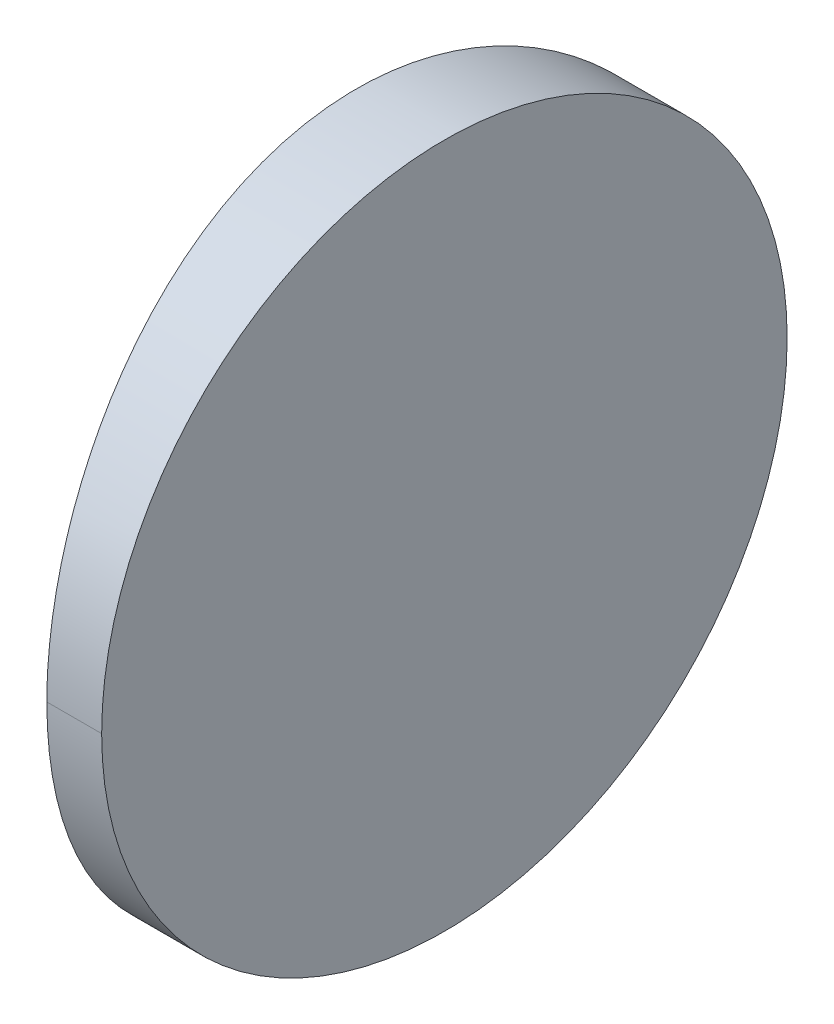
ISO-10303-21;
HEADER;
FILE_DESCRIPTION(('STEP AP214'),'2;1');
FILE_NAME('part.step','',(''),(''),'','','');
FILE_SCHEMA(('AUTOMOTIVE_DESIGN { 1 0 10303 214 1 1 1 1 }'));
ENDSEC;
DATA;
#1=APPLICATION_CONTEXT('core data for automotive mechanical design processes');
#2=APPLICATION_PROTOCOL_DEFINITION('international standard','automotive_design',2000,#1);
#3=PRODUCT_CONTEXT('',#1,'mechanical');
#4=PRODUCT('Part','Part','',(#3));
#5=PRODUCT_RELATED_PRODUCT_CATEGORY('part','',(#4));
#6=PRODUCT_DEFINITION_FORMATION('','',#4);
#7=PRODUCT_DEFINITION_CONTEXT('part definition',#1,'design');
#8=PRODUCT_DEFINITION('design','',#6,#7);
#9=PRODUCT_DEFINITION_SHAPE('','',#8);
#10=(LENGTH_UNIT() NAMED_UNIT(*) SI_UNIT(.MILLI.,.METRE.));
#11=(NAMED_UNIT(*) PLANE_ANGLE_UNIT() SI_UNIT($,.RADIAN.));
#12=(NAMED_UNIT(*) SI_UNIT($,.STERADIAN.) SOLID_ANGLE_UNIT());
#13=UNCERTAINTY_MEASURE_WITH_UNIT(LENGTH_MEASURE(1.E-05),#10,'distance_accuracy_value','');
#14=(GEOMETRIC_REPRESENTATION_CONTEXT(3) GLOBAL_UNCERTAINTY_ASSIGNED_CONTEXT((#13)) GLOBAL_UNIT_ASSIGNED_CONTEXT((#10,
#11,#12)) REPRESENTATION_CONTEXT('',''));
#15=CARTESIAN_POINT('',(0.,0.,0.));
#16=DIRECTION('',(0.,0.,1.));
#17=DIRECTION('',(1.,0.,0.));
#18=AXIS2_PLACEMENT_3D('',#15,#16,#17);
#19=CARTESIAN_POINT('',(-69.7247956651487,12.5,0.));
#20=DIRECTION('',(1.,0.,0.));
#21=DIRECTION('',(0.,0.,-1.));
#22=AXIS2_PLACEMENT_3D('',#19,#20,#21);
#23=CYLINDRICAL_SURFACE('',#22,12.5);
#24=DIRECTION('',(1.,0.,0.));
#25=VECTOR('',#24,1.);
#26=CARTESIAN_POINT('',(-69.7247956651487,12.5,12.5));
#27=LINE('',#26,#25);
#28=CARTESIAN_POINT('',(-59.0238931658232,12.5,12.5));
#29=VERTEX_POINT('',#28);
#30=CARTESIAN_POINT('',(-57.0247956651487,12.5,12.5));
#31=VERTEX_POINT('',#30);
#32=EDGE_CURVE('E60',#29,#31,#27,.T.);
#33=ORIENTED_EDGE('',*,*,#32,.F.);
#34=CARTESIAN_POINT('',(-59.0238931658232,12.5,12.5));
#35=CARTESIAN_POINT('',(-59.0238934111165,12.2973949439866,12.5000048487893));
#36=CARTESIAN_POINT('',(-59.0248782924547,12.0947905182912,12.4950743511268));
#37=CARTESIAN_POINT('',(-59.0287915261321,11.6886838905723,12.47530944615));
#38=CARTESIAN_POINT('',(-59.0317332263051,11.485185124926,12.4604070142007));
#39=CARTESIAN_POINT('',(-59.0395603444199,11.0777895177739,12.4205276454164));
#40=CARTESIAN_POINT('',(-59.0444591006648,10.8738997028536,12.3954815580978));
#41=CARTESIAN_POINT('',(-59.0561984617056,10.4662368020218,12.3351755541053));
#42=CARTESIAN_POINT('',(-59.0630523724705,10.2624744495084,12.2998456149912));
#43=CARTESIAN_POINT('',(-59.0783295032355,9.86547745771631,12.2208236543586));
#44=CARTESIAN_POINT('',(-59.0866753880738,9.672158062974,12.1775416438496));
#45=CARTESIAN_POINT('',(-59.1052113046292,9.28328809657888,12.0807227425628));
#46=CARTESIAN_POINT('',(-59.1154405243487,9.08779404606097,12.0269661621223));
#47=CARTESIAN_POINT('',(-59.1377444754954,8.69520669811822,11.9086755495263));
#48=CARTESIAN_POINT('',(-59.1498566932323,8.49818248545563,11.8439193495794));
#49=CARTESIAN_POINT('',(-59.1759227856845,8.10322170817393,11.703131650437));
#50=CARTESIAN_POINT('',(-59.1899124267658,7.90536722090443,11.6268762660254));
#51=CARTESIAN_POINT('',(-59.2177827510402,7.5357126946986,11.4735047580379));
#52=CARTESIAN_POINT('',(-59.2315018120931,7.3634664507522,11.3974317322579));
#53=CARTESIAN_POINT('',(-59.2607658139538,7.0133058751308,11.2332363969494));
#54=CARTESIAN_POINT('',(-59.2763696279973,6.83559876632946,11.1446820766058));
#55=CARTESIAN_POINT('',(-59.3094138727951,6.47554628750818,10.9544305060887));
#56=CARTESIAN_POINT('',(-59.3269076191299,6.29344052190166,10.8522891966566));
#57=CARTESIAN_POINT('',(-59.3636980281173,5.92575435694138,10.6337789938174));
#58=CARTESIAN_POINT('',(-59.3830410689332,5.74044773231712,10.5169562300519));
#59=CARTESIAN_POINT('',(-59.4166325799122,5.43250573682875,10.3113260100417));
#60=CARTESIAN_POINT('',(-59.4306112820348,5.30817627826116,10.2249974818105));
#61=CARTESIAN_POINT('',(-59.4621916722735,5.03400217167407,10.0271511242854));
#62=CARTESIAN_POINT('',(-59.479874883603,4.88500412630378,9.91447037014707));
#63=CARTESIAN_POINT('',(-59.5188726532772,4.56442798897067,9.66054156832797));
#64=CARTESIAN_POINT('',(-59.5402394172289,4.39393175259182,9.5179306797465));
#65=CARTESIAN_POINT('',(-59.5737385653417,4.13413245224687,9.28858103553876));
#66=CARTESIAN_POINT('',(-59.5857963020602,4.04212087523037,9.2048765159832));
#67=CARTESIAN_POINT('',(-59.610846306173,3.85417370185836,9.02870072537075));
#68=CARTESIAN_POINT('',(-59.6238439507349,3.75842557814165,8.93602973952716));
#69=CARTESIAN_POINT('',(-59.649499295712,3.57237392203008,8.75010509869603));
#70=CARTESIAN_POINT('',(-59.6621571104779,3.48199364619068,8.65692823434419));
#71=CARTESIAN_POINT('',(-59.6866035930923,3.30966309908345,8.47363800993337));
#72=CARTESIAN_POINT('',(-59.698397687726,3.22753681411497,8.38369049997133));
#73=CARTESIAN_POINT('',(-59.7313443970929,3.00109198214809,8.12827995684195));
#74=CARTESIAN_POINT('',(-59.7524116670259,2.85975461505502,7.96014309730327));
#75=CARTESIAN_POINT('',(-59.7911112899006,2.60608967186918,7.64170888810293));
#76=CARTESIAN_POINT('',(-59.8087962335007,2.4925386794846,7.49238910309623));
#77=CARTESIAN_POINT('',(-59.8406874128334,2.29107093903635,7.21470395692166));
#78=CARTESIAN_POINT('',(-59.8549716685329,2.20208960897634,7.08711829251616));
#79=CARTESIAN_POINT('',(-59.8887334359053,1.99362840484857,6.77599335657102));
#80=CARTESIAN_POINT('',(-59.9079547421535,1.87649932522733,6.5908428677263));
#81=CARTESIAN_POINT('',(-59.944521358798,1.657160100832,6.22306830279903));
#82=CARTESIAN_POINT('',(-59.9619121867267,1.55451515544169,6.04070753043465));
#83=CARTESIAN_POINT('',(-59.9947775949263,1.36309985442087,5.67971785469299));
#84=CARTESIAN_POINT('',(-60.0103038936127,1.27390305776435,5.50131984263335));
#85=CARTESIAN_POINT('',(-60.0394389300154,1.10832183152403,5.14933020635574));
#86=CARTESIAN_POINT('',(-60.0531045709718,1.03152145827128,4.9759387112348));
#87=CARTESIAN_POINT('',(-60.0807045317124,0.877519681840199,4.60571506184639));
#88=CARTESIAN_POINT('',(-60.0944905875027,0.801278438313892,4.40847140619934));
#89=CARTESIAN_POINT('',(-60.120186381391,0.660383119625356,4.01451164396618));
#90=CARTESIAN_POINT('',(-60.1321297676538,0.595517233957023,3.81787340502622));
#91=CARTESIAN_POINT('',(-60.1541335048892,0.476907113149795,3.42582340846234));
#92=CARTESIAN_POINT('',(-60.164229030936,0.422952464940169,3.23047729560302));
#93=CARTESIAN_POINT('',(-60.1825353871569,0.325672560345824,2.84165838920926));
#94=CARTESIAN_POINT('',(-60.1907828940336,0.282139000408903,2.64823939623316));
#95=CARTESIAN_POINT('',(-60.2059170931917,0.20244768597724,2.2501888937517));
#96=CARTESIAN_POINT('',(-60.2127198627724,0.166742131456625,2.04546346421591));
#97=CARTESIAN_POINT('',(-60.2243726206814,0.105775976861482,1.63579191468708));
#98=CARTESIAN_POINT('',(-60.2292352047992,0.0804479752817121,1.43085617499422));
#99=CARTESIAN_POINT('',(-60.2370059031225,0.0401033624794922,1.02129310712265));
#100=CARTESIAN_POINT('',(-60.2399266300464,0.0250201950583852,0.81667257570597));
#101=CARTESIAN_POINT('',(-60.2438140934801,0.00500669497695635,0.408253819180883));
#102=CARTESIAN_POINT('',(-60.2447934378603,1.08485243830229E-05,0.204458923445379));
#103=CARTESIAN_POINT('',(-60.2447978740114,-1.07567542771398E-05,-0.202067844350763));
#104=CARTESIAN_POINT('',(-60.2438331344716,0.00491160640269099,-0.404799715497574));
#105=CARTESIAN_POINT('',(-60.2399946201356,0.0246734743669953,-0.811087000469519));
#106=CARTESIAN_POINT('',(-60.2371084377355,0.0395774385472782,-1.01463916394297));
#107=CARTESIAN_POINT('',(-60.2294265815683,0.0794567317074173,-1.42206787178189));
#108=CARTESIAN_POINT('',(-60.224618495236,0.104497542897704,-1.6259377713288));
#109=CARTESIAN_POINT('',(-60.2130946585849,0.164780613090618,-2.03348826320776));
#110=CARTESIAN_POINT('',(-60.2063665132944,0.200089184892833,-2.2371587039275));
#111=CARTESIAN_POINT('',(-60.1913482363497,0.27915388993501,-2.63444738439542));
#112=CARTESIAN_POINT('',(-60.1831300588858,0.322522552495164,-2.82814560434876));
#113=CARTESIAN_POINT('',(-60.1648772446016,0.419491917976083,-3.21752706113229));
#114=CARTESIAN_POINT('',(-60.1548058509666,0.473301155055215,-3.41315668249607));
#115=CARTESIAN_POINT('',(-60.1328454481412,0.591640444610163,-3.80577672272048));
#116=CARTESIAN_POINT('',(-60.1209211881419,0.656381149021078,-4.0027016652233));
#117=CARTESIAN_POINT('',(-60.0952586411178,0.797046757205778,-4.39723659020499));
#118=CARTESIAN_POINT('',(-60.08148662873,0.873183717283128,-4.59476885355065));
#119=CARTESIAN_POINT('',(-60.053956617042,1.0267407417369,-4.9648865957859));
#120=CARTESIAN_POINT('',(-60.0403519961969,1.10316859352795,-5.13789625311636));
#121=CARTESIAN_POINT('',(-60.0113511044938,1.26791249048456,-5.48905646137268));
#122=CARTESIAN_POINT('',(-59.9958985599109,1.35663896599683,-5.66701005984294));
#123=CARTESIAN_POINT('',(-59.9631928593356,1.54700700771221,-6.02705829441964));
#124=CARTESIAN_POINT('',(-59.9458885159019,1.64906925750177,-6.20892579298482));
#125=CARTESIAN_POINT('',(-59.9095070861721,1.86712211151395,-6.57567673221329));
#126=CARTESIAN_POINT('',(-59.8903849174355,1.98354156366039,-6.7603012433079));
#127=CARTESIAN_POINT('',(-59.8566496017715,2.19162906383489,-7.07191712362963));
#128=CARTESIAN_POINT('',(-59.8422867858668,2.28101102050511,-7.20047003907686));
#129=CARTESIAN_POINT('',(-59.8102385491528,2.48328099934842,-7.48003218376792));
#130=CARTESIAN_POINT('',(-59.7924741248237,2.59723899435782,-7.63025982608186));
#131=CARTESIAN_POINT('',(-59.7536155955863,2.85173173895894,-7.9504422113));
#132=CARTESIAN_POINT('',(-59.7324680769503,2.99349456000898,-8.1194177767963));
#133=CARTESIAN_POINT('',(-59.6993987532632,3.22061539132784,-8.37603534242138));
#134=CARTESIAN_POINT('',(-59.6875643793713,3.30296361981507,-8.46637242434928));
#135=CARTESIAN_POINT('',(-59.6630371371057,3.47574501882702,-8.65042064089451));
#136=CARTESIAN_POINT('',(-59.6503387642659,3.56635463616604,-8.74396576395325));
#137=CARTESIAN_POINT('',(-59.6246783072099,3.75232421022672,-8.93005158546302));
#138=CARTESIAN_POINT('',(-59.6117161106175,3.84774329380468,-9.02253319092564));
#139=CARTESIAN_POINT('',(-59.5867379033952,4.03500473326411,-9.19832747909939));
#140=CARTESIAN_POINT('',(-59.5747165910804,4.12665949532594,-9.28183971448949));
#141=CARTESIAN_POINT('',(-59.5413320438138,4.38532663699196,-9.51057522387746));
#142=CARTESIAN_POINT('',(-59.5200415134037,4.5550271542648,-9.65279185551949));
#143=CARTESIAN_POINT('',(-59.4811995246292,4.87390834399103,-9.90592004935866));
#144=CARTESIAN_POINT('',(-59.4635967004774,5.02200756881771,-10.0181911209653));
#145=CARTESIAN_POINT('',(-59.4321801263303,5.2942865804486,-10.215198247502));
#146=CARTESIAN_POINT('',(-59.4182858315008,5.41762105582,-10.3010924983991));
#147=CARTESIAN_POINT('',(-59.3846710683119,5.72507765481962,-10.5070794819256));
#148=CARTESIAN_POINT('',(-59.3652263458907,5.9109451370394,-10.6246268079066));
#149=CARTESIAN_POINT('',(-59.3282464030829,6.27972006060333,-10.8444451359443));
#150=CARTESIAN_POINT('',(-59.3106643547472,6.46234903188176,-10.9471764656644));
#151=CARTESIAN_POINT('',(-59.2774576726362,6.82339707526118,-11.1384832492065));
#152=CARTESIAN_POINT('',(-59.261779158766,7.00157253121048,-11.2275089837338));
#153=CARTESIAN_POINT('',(-59.2323800118476,7.35260378264038,-11.3925384661496));
#154=CARTESIAN_POINT('',(-59.2185998323817,7.52524897824578,-11.4689801568464));
#155=CARTESIAN_POINT('',(-59.1906593651612,7.89505582702475,-11.6227924749215));
#156=CARTESIAN_POINT('',(-59.1766556862318,8.09265132083762,-11.6991512886893));
#157=CARTESIAN_POINT('',(-59.150556768491,8.48709613465402,-11.8401641096268));
#158=CARTESIAN_POINT('',(-59.1384258378319,8.68386321768595,-11.9050417919945));
#159=CARTESIAN_POINT('',(-59.1160797981408,9.07593941554491,-12.0235930314992));
#160=CARTESIAN_POINT('',(-59.1058272754873,9.27117926918379,-12.0774885528716));
#161=CARTESIAN_POINT('',(-59.0872399120019,9.65954483685961,-12.1746023324143));
#162=CARTESIAN_POINT('',(-59.0788659599775,9.85261383987354,-12.2180400842456));
#163=CARTESIAN_POINT('',(-59.0634745148696,10.2504399563658,-12.2976695113297));
#164=CARTESIAN_POINT('',(-59.0565466117767,10.4552958894061,-12.3333858922751));
#165=CARTESIAN_POINT('',(-59.0446807261429,10.8651521515466,-12.3943495365733));
#166=CARTESIAN_POINT('',(-59.0397291850555,11.0701414818917,-12.4196681681201));
#167=CARTESIAN_POINT('',(-59.0318177900048,11.4797336564933,-12.459979947368));
#168=CARTESIAN_POINT('',(-59.0288443446259,11.6843293002299,-12.4750435738634));
#169=CARTESIAN_POINT('',(-59.0248889531182,12.0926187653779,-12.4950214140943));
#170=CARTESIAN_POINT('',(-59.0238934044035,12.2963090657991,-12.500004955905));
#171=CARTESIAN_POINT('',(-59.0238931658232,12.5000000000001,-12.5));
#172=B_SPLINE_CURVE_WITH_KNOTS('',3,(#34,#35,#36,#37,#38,#39,#40,#41,#42,#43,#44,#45,#46,#47,
#48,#49,#50,#51,#52,#53,#54,#55,#56,#57,#58,#59,#60,#61,#62,#63,#64,#65,#66,#67,#68,#69,#70,#71,
#72,#73,#74,#75,#76,#77,#78,#79,#80,#81,#82,#83,#84,#85,#86,#87,#88,#89,#90,#91,#92,#93,#94,#95,
#96,#97,#98,#99,#100,#101,#102,#103,#104,#105,#106,#107,#108,#109,#110,#111,#112,#113,#114,#115,
#116,#117,#118,#119,#120,#121,#122,#123,#124,#125,#126,#127,#128,#129,#130,#131,#132,#133,#134,
#135,#136,#137,#138,#139,#140,#141,#142,#143,#144,#145,#146,#147,#148,#149,#150,#151,#152,#153,
#154,#155,#156,#157,#158,#159,#160,#161,#162,#163,#164,#165,#166,#167,#168,#169,#170,#171),
.UNSPECIFIED.,.F.,.F.,(4,2,2,2,2,2,2,2,2,2,2,2,2,2,2,2,2,2,2,2,2,2,2,2,2,2,2,2,2,2,2,2,2,2,2,2,
2,2,2,2,2,2,2,2,2,2,2,2,2,2,2,2,2,2,2,2,2,2,2,2,2,2,2,2,2,2,2,2,4),(0.,0.607752157813164,
1.21969301064746,1.83587770512788,2.45636025589361,3.05097541710052,3.65975259130253,
4.28273172369931,4.91995007201459,5.48615070409916,6.08340362164191,6.71172550822567,
7.37113051738123,7.82705873396953,8.3898048142942,9.05936071145659,9.43423023083276,
9.83580742831936,10.2270185263446,10.594084747146,11.2557249284191,11.8208052869677,
12.2893199267801,12.9487882288098,13.5784844265259,14.1784232674411,14.7486219829741,
15.3840820858889,16.00603783445,16.6145257393094,17.2095848053072,17.8330964235955,
18.452491606132,19.0678233431868,19.679145682106,20.2872787497822,20.8993773919695,
21.515494836714,22.1356832769347,22.7314459497587,23.3406326138324,23.9632825138026,
24.599432388453,25.168123778604,25.7662299309603,26.3937680498447,27.0507528809537,
27.5223420418294,28.0903365446505,28.7547305649361,29.1231140275348,29.5156023510727,
29.9160707788695,30.2897557881249,30.9567161062252,31.5165634239584,31.9692896134215,
32.6312904406251,33.2618593615865,33.8610105302625,34.428760657435,35.0653709554213,
35.6877364470198,36.2958941740028,36.8898838540493,37.51379800248,38.133355110703,
38.7486100468607,39.3596188385676),.UNSPECIFIED.);
#173=CARTESIAN_POINT('',(-59.0238931658232,12.5,-12.5));
#174=VERTEX_POINT('',#173);
#175=EDGE_CURVE('E27',#29,#174,#172,.T.);
#176=ORIENTED_EDGE('',*,*,#175,.T.);
#177=DIRECTION('',(1.,0.,0.));
#178=VECTOR('',#177,1.);
#179=CARTESIAN_POINT('',(-69.7247956651487,12.5,-12.5));
#180=LINE('',#179,#178);
#181=CARTESIAN_POINT('',(-57.0247956651487,12.5,-12.5));
#182=VERTEX_POINT('',#181);
#183=EDGE_CURVE('E57',#174,#182,#180,.T.);
#184=ORIENTED_EDGE('',*,*,#183,.T.);
#185=CARTESIAN_POINT('',(-57.0247956651487,12.5,0.));
#186=DIRECTION('',(1.,0.,0.));
#187=DIRECTION('',(0.,0.,-1.));
#188=AXIS2_PLACEMENT_3D('',#185,#186,#187);
#189=CIRCLE('',#188,12.5);
#190=EDGE_CURVE('E9',#31,#182,#189,.T.);
#191=ORIENTED_EDGE('',*,*,#190,.F.);
#192=EDGE_LOOP('',(#33,#176,#184,#191));
#193=FACE_BOUND('',#192,.T.);
#194=ADVANCED_FACE('F15',(#193),#23,.T.);
#195=CARTESIAN_POINT('',(-57.0247956651487,25.,-12.5));
#196=DIRECTION('',(1.,0.,0.));
#197=DIRECTION('',(0.,0.,-1.));
#198=AXIS2_PLACEMENT_3D('',#195,#196,#197);
#199=PLANE('',#198);
#200=CARTESIAN_POINT('',(-57.0247956651487,12.5,0.));
#201=DIRECTION('',(1.,0.,0.));
#202=DIRECTION('',(0.,0.,-1.));
#203=AXIS2_PLACEMENT_3D('',#200,#201,#202);
#204=CIRCLE('',#203,12.5);
#205=EDGE_CURVE('E71',#182,#31,#204,.T.);
#206=ORIENTED_EDGE('',*,*,#205,.T.);
#207=ORIENTED_EDGE('',*,*,#190,.T.);
#208=EDGE_LOOP('',(#206,#207));
#209=FACE_BOUND('',#208,.T.);
#210=ADVANCED_FACE('F17',(#209),#199,.T.);
#211=CARTESIAN_POINT('',(4.35520433485127,25.,0.));
#212=DIRECTION('',(0.,-1.,0.));
#213=DIRECTION('',(0.,0.,-1.));
#214=AXIS2_PLACEMENT_3D('',#211,#212,#213);
#215=CYLINDRICAL_SURFACE('',#214,64.6);
#216=CARTESIAN_POINT('',(-59.0238931658232,12.5,-12.5));
#217=CARTESIAN_POINT('',(-59.0238934111924,12.7026137310428,-12.5000048496214));
#218=CARTESIAN_POINT('',(-59.0248783780506,12.905226831634,-12.4950739293313));
#219=CARTESIAN_POINT('',(-59.0287919492767,13.3113509287286,-12.4753073262798));
#220=CARTESIAN_POINT('',(-59.0317339038026,13.5148584881078,-12.460403607009));
#221=CARTESIAN_POINT('',(-59.0395616972004,13.9222717362712,-12.4205207809279));
#222=CARTESIAN_POINT('',(-59.0444608766807,14.1261703969372,-12.3954725115462));
#223=CARTESIAN_POINT('',(-59.0562012502951,14.5338509734652,-12.335161236359));
#224=CARTESIAN_POINT('',(-59.0630557526782,14.7376221535834,-12.2998281958788));
#225=CARTESIAN_POINT('',(-59.0783341667693,15.1346353694732,-12.2207994609467));
#226=CARTESIAN_POINT('',(-59.0866807297262,15.3279621797102,-12.1775138510316));
#227=CARTESIAN_POINT('',(-59.105218154475,15.7168473331397,-12.0806868269011));
#228=CARTESIAN_POINT('',(-59.1154482110442,15.9123491423932,-12.0269256830036));
#229=CARTESIAN_POINT('',(-59.1377539883908,16.3049522671996,-11.9086249222454));
#230=CARTESIAN_POINT('',(-59.1498672017794,16.5019844822288,-11.8438630969144));
#231=CARTESIAN_POINT('',(-59.1759354364811,16.8969614141069,-11.7030630326878));
#232=CARTESIAN_POINT('',(-59.1899262299697,17.0948240347539,-11.6268008674546));
#233=CARTESIAN_POINT('',(-59.2177986322114,17.4644908071279,-11.4734168062891));
#234=CARTESIAN_POINT('',(-59.2315185902433,17.6367412737657,-11.3973382146804));
#235=CARTESIAN_POINT('',(-59.2607845674822,17.9869115156648,-11.2331303540052));
#236=CARTESIAN_POINT('',(-59.2763894697759,18.1646240152278,-11.1445689844288));
#237=CARTESIAN_POINT('',(-59.3094360800438,18.5246882892123,-10.9543016831608));
#238=CARTESIAN_POINT('',(-59.3269311120342,18.7068003965977,-10.8521515977848));
#239=CARTESIAN_POINT('',(-59.3637242531405,19.0745000152974,-10.6336219663541));
#240=CARTESIAN_POINT('',(-59.3830687457017,19.2598136788946,-10.5167884514917));
#241=CARTESIAN_POINT('',(-59.4166608699823,19.567749150979,-10.3111511098607));
#242=CARTESIAN_POINT('',(-59.4306386394916,19.6920657287721,-10.2248270659786));
#243=CARTESIAN_POINT('',(-59.4622184770414,19.9662259297767,-10.0269813087319));
#244=CARTESIAN_POINT('',(-59.4799020846251,20.1152226055151,-9.91429624894744));
#245=CARTESIAN_POINT('',(-59.5189019647849,20.4358067353449,-9.6603491221328));
#246=CARTESIAN_POINT('',(-59.5402704423276,20.6063118119016,-9.51772361612715));
#247=CARTESIAN_POINT('',(-59.5737726205456,20.8661272157849,-9.28834733765323));
#248=CARTESIAN_POINT('',(-59.5858317113641,20.9581464390574,-9.20463107101296));
#249=CARTESIAN_POINT('',(-59.6108847586201,21.1461107576208,-9.02842857416261));
#250=CARTESIAN_POINT('',(-59.6238840922686,21.2418682747806,-8.9357425282914));
#251=CARTESIAN_POINT('',(-59.6495407369368,21.4279231277709,-8.74980195734499));
#252=CARTESIAN_POINT('',(-59.6621981639781,21.5182976802979,-8.65662469116178));
#253=CARTESIAN_POINT('',(-59.6866440613566,21.6906186918445,-8.47333235623552));
#254=CARTESIAN_POINT('',(-59.6984379597661,21.7727411138351,-8.38338307919454));
#255=CARTESIAN_POINT('',(-59.7313847233437,21.9991796796744,-8.12796259901116));
#256=CARTESIAN_POINT('',(-59.7524521852117,22.1405143509527,-7.95981747772353));
#257=CARTESIAN_POINT('',(-59.7911529465538,22.3941801021566,-7.64135993966781));
#258=CARTESIAN_POINT('',(-59.8088388489227,22.5077343214143,-7.49202480128374));
#259=CARTESIAN_POINT('',(-59.8407327133887,22.7092138947159,-7.21430140706565));
#260=CARTESIAN_POINT('',(-59.8550187001781,22.7982036589031,-7.08669266327341));
#261=CARTESIAN_POINT('',(-59.8887819633561,23.006668362867,-6.7755334045273));
#262=CARTESIAN_POINT('',(-59.9080030534178,23.1237928792244,-6.59037207600416));
#263=CARTESIAN_POINT('',(-59.9445691258585,23.3431230938062,-6.22257511448892));
#264=CARTESIAN_POINT('',(-59.9619596303103,23.4457635673887,-6.04020274400753));
#265=CARTESIAN_POINT('',(-59.9948242966009,23.6371699535956,-5.6791890979548));
#266=CARTESIAN_POINT('',(-60.0103501800445,23.7263622849623,-5.50077867619185));
#267=CARTESIAN_POINT('',(-60.0394842880874,23.8919345333957,-5.14876340026277));
#268=CARTESIAN_POINT('',(-60.0531494187075,23.9687303750163,-4.97535864113635));
#269=CARTESIAN_POINT('',(-60.0807478514289,24.1227204415844,-4.60510946931091));
#270=CARTESIAN_POINT('',(-60.0945328786791,24.1989545067865,-4.40785361377381));
#271=CARTESIAN_POINT('',(-60.1202264176381,24.3398348754379,-4.01386916068712));
#272=CARTESIAN_POINT('',(-60.1321685771063,24.4046929724255,-3.81721841159377));
#273=CARTESIAN_POINT('',(-60.1541696639558,24.5232868743717,-3.42514312288581));
#274=CARTESIAN_POINT('',(-60.1642637656208,24.5772330756997,-3.22978420976227));
#275=CARTESIAN_POINT('',(-60.182567076752,24.6744954014337,-2.84093945422784));
#276=CARTESIAN_POINT('',(-60.1908129617311,24.7180198130002,-2.64750739495035));
#277=CARTESIAN_POINT('',(-60.2059434488096,24.7976906447328,-2.2494335229782));
#278=CARTESIAN_POINT('',(-60.2127441428013,24.8333849599437,-2.04469783947555));
#279=CARTESIAN_POINT('',(-60.224392564575,24.8943279314669,-1.63500554883729));
#280=CARTESIAN_POINT('',(-60.2292528818676,24.9196439537904,-1.43005931207862));
#281=CARTESIAN_POINT('',(-60.2370188621836,24.9599638230241,-1.02047505994399));
#282=CARTESIAN_POINT('',(-60.2399371314023,24.9750341904707,-0.815843833173669));
#283=CARTESIAN_POINT('',(-60.243819494925,24.9950212287414,-0.407403543528114));
#284=CARTESIAN_POINT('',(-60.2447961903435,25.0000033776201,-0.203597803650388));
#285=CARTESIAN_POINT('',(-60.2447951420837,24.9999966369174,0.202928323776959));
#286=CARTESIAN_POINT('',(-60.2438277736564,24.9950606791804,0.405648714267264));
#287=CARTESIAN_POINT('',(-60.239984210526,24.9752726140678,0.811913181783669));
#288=CARTESIAN_POINT('',(-60.2370956017444,24.9603560130665,1.01545400225052));
#289=CARTESIAN_POINT('',(-60.2294091011813,24.9204523647995,1.42286022378824));
#290=CARTESIAN_POINT('',(-60.2245987905867,24.895399801159,1.62671897214936));
#291=CARTESIAN_POINT('',(-60.2130707139409,24.8350940669239,2.03424741268839));
#292=CARTESIAN_POINT('',(-60.2063405469092,24.7997745495404,2.23790694369438));
#293=CARTESIAN_POINT('',(-60.191318597312,24.7206895969467,2.63517258760994));
#294=CARTESIAN_POINT('',(-60.1830987699932,24.6773116518944,2.82885870971672));
#295=CARTESIAN_POINT('',(-60.16484283722,24.5803243434283,3.21821627357754));
#296=CARTESIAN_POINT('',(-60.154769973213,24.5265064264651,3.41383408176827));
#297=CARTESIAN_POINT('',(-60.1328068105905,24.4081503491636,3.80643081471769));
#298=CARTESIAN_POINT('',(-60.1208812598588,24.3434015171504,4.00334424395089));
#299=CARTESIAN_POINT('',(-60.0952163124007,24.202720171662,4.39785647285391));
#300=CARTESIAN_POINT('',(-60.0814431894122,24.126575581854,4.59537753307309));
#301=CARTESIAN_POINT('',(-60.0539115875403,23.9730064993007,4.96547023918089));
#302=CARTESIAN_POINT('',(-60.0403064865793,23.8965742886372,5.13846615417974));
#303=CARTESIAN_POINT('',(-60.011304738929,23.7318218375041,5.48959971323656));
#304=CARTESIAN_POINT('',(-59.9958518218319,23.6430911519656,5.66754037316224));
#305=CARTESIAN_POINT('',(-59.9631454767993,23.4527147956711,6.0275635372446));
#306=CARTESIAN_POINT('',(-59.9458408650642,23.350648423668,6.20941886921058));
#307=CARTESIAN_POINT('',(-59.9094590132205,23.1325873603969,6.57614624491336));
#308=CARTESIAN_POINT('',(-59.8903366955698,23.0161638007568,6.76075932125791));
#309=CARTESIAN_POINT('',(-59.8566029015856,22.8080800168882,7.07234064652951));
#310=CARTESIAN_POINT('',(-59.8422417722938,22.7187062180518,7.20087081386404));
#311=CARTESIAN_POINT('',(-59.8101961406205,22.5164475702185,7.48039530128415));
#312=CARTESIAN_POINT('',(-59.7924326391912,22.4024925748463,7.6306078488637));
#313=CARTESIAN_POINT('',(-59.7535751854931,22.1480002308722,7.95076734793983));
#314=CARTESIAN_POINT('',(-59.7324278315196,22.0062345333479,8.1197348358382));
#315=CARTESIAN_POINT('',(-59.699358524626,21.7791071765943,8.37634270541115));
#316=CARTESIAN_POINT('',(-59.6875239441292,21.6967550127207,8.46667808433365));
#317=CARTESIAN_POINT('',(-59.6629960980273,21.523963945692,8.65072430008703));
#318=CARTESIAN_POINT('',(-59.6502973292314,21.4333485451403,8.74426906716104));
#319=CARTESIAN_POINT('',(-59.62463816782,21.2473821445787,8.93033896728279));
#320=CARTESIAN_POINT('',(-59.6116776644619,21.1519724925611,9.02280547790663));
#321=CARTESIAN_POINT('',(-59.5867025048189,20.9647282475004,9.19857302019501));
#322=CARTESIAN_POINT('',(-59.5746825468768,20.873081142001,9.2820735029664));
#323=CARTESIAN_POINT('',(-59.5413010188965,20.6144300492287,9.51078244700964));
#324=CARTESIAN_POINT('',(-59.5200121909124,20.4447383017005,9.65298453049006));
#325=CARTESIAN_POINT('',(-59.4811722751292,20.1258648375073,9.90609463821919));
#326=CARTESIAN_POINT('',(-59.4635698206002,19.977764043902,10.018361571637));
#327=CARTESIAN_POINT('',(-59.4321526253146,19.7054705966427,10.2153697275445));
#328=CARTESIAN_POINT('',(-59.4182573557586,19.5821229091239,10.3012687248224));
#329=CARTESIAN_POINT('',(-59.3846432006364,19.2746597015203,10.5072485774652));
#330=CARTESIAN_POINT('',(-59.3651999644328,19.0887995269636,10.6247849059412));
#331=CARTESIAN_POINT('',(-59.328222816342,18.7200385803024,10.8445833780035));
#332=CARTESIAN_POINT('',(-59.3106420819769,18.5374162028504,10.9473057474891));
#333=CARTESIAN_POINT('',(-59.2774378149226,18.1763804352854,11.138596488728));
#334=CARTESIAN_POINT('',(-59.2617604108595,17.9982105966812,11.2276150436015));
#335=CARTESIAN_POINT('',(-59.2323632754077,17.6471894336001,11.3926317885435));
#336=CARTESIAN_POINT('',(-59.2185840077961,17.4745486545278,11.4690678287546));
#337=CARTESIAN_POINT('',(-59.1906456131453,17.1047540491242,11.6228676218479));
#338=CARTESIAN_POINT('',(-59.1766430693827,16.9071664827834,11.6992197473823));
#339=CARTESIAN_POINT('',(-59.1505462635098,16.5127374108918,11.840220363837));
#340=CARTESIAN_POINT('',(-59.138416315253,16.3159781236661,11.9050924894677));
#341=CARTESIAN_POINT('',(-59.1160720792881,15.9239172908693,12.0236336948936));
#342=CARTESIAN_POINT('',(-59.1058203841486,15.7286849908806,12.0775246988737));
#343=CARTESIAN_POINT('',(-59.0872345142275,15.3403342033414,12.1746304259605));
#344=CARTESIAN_POINT('',(-59.0788612349103,15.1472724141179,12.2180646033285));
#345=CARTESIAN_POINT('',(-59.0634710803945,14.7494624129022,12.2976872126196));
#346=CARTESIAN_POINT('',(-59.0565437784219,14.5446154046677,12.3334004409402));
#347=CARTESIAN_POINT('',(-59.0446789215936,14.1347770114314,12.3943587277806));
#348=CARTESIAN_POINT('',(-59.0397278105468,13.9297966227519,12.4196751418496));
#349=CARTESIAN_POINT('',(-59.0318171016054,13.5202222782012,12.4599834083076));
#350=CARTESIAN_POINT('',(-59.0288439146775,13.31563552126,12.4750457269971));
#351=CARTESIAN_POINT('',(-59.024888866129,12.9073637072842,12.4950218424674));
#352=CARTESIAN_POINT('',(-59.0238934043245,12.703682170465,12.50000495505));
#353=CARTESIAN_POINT('',(-59.0238931658232,12.5,12.5));
#354=B_SPLINE_CURVE_WITH_KNOTS('',3,(#216,#217,#218,#219,#220,#221,#222,#223,#224,#225,#226,
#227,#228,#229,#230,#231,#232,#233,#234,#235,#236,#237,#238,#239,#240,#241,#242,#243,#244,#245,
#246,#247,#248,#249,#250,#251,#252,#253,#254,#255,#256,#257,#258,#259,#260,#261,#262,#263,#264,
#265,#266,#267,#268,#269,#270,#271,#272,#273,#274,#275,#276,#277,#278,#279,#280,#281,#282,#283,
#284,#285,#286,#287,#288,#289,#290,#291,#292,#293,#294,#295,#296,#297,#298,#299,#300,#301,#302,
#303,#304,#305,#306,#307,#308,#309,#310,#311,#312,#313,#314,#315,#316,#317,#318,#319,#320,#321,
#322,#323,#324,#325,#326,#327,#328,#329,#330,#331,#332,#333,#334,#335,#336,#337,#338,#339,#340,
#341,#342,#343,#344,#345,#346,#347,#348,#349,#350,#351,#352,#353),.UNSPECIFIED.,.F.,.F.,(4,2,2,
2,2,2,2,2,2,2,2,2,2,2,2,2,2,2,2,2,2,2,2,2,2,2,2,2,2,2,2,2,2,2,2,2,2,2,2,2,2,2,2,2,2,2,2,2,2,2,2,
2,2,2,2,2,2,2,2,2,2,2,2,2,2,2,2,2,4),(0.,0.607778174742056,1.21974559556208,1.83595741610242,
2.4564676577772,3.05110692426882,3.65991023318326,4.28291753357835,4.92016608651513,
5.48638518268571,6.08366216135066,6.71201370578129,7.37145396885051,7.82734270958355,
8.39009339175427,9.05969795889714,9.43460834855857,9.83623743497663,10.2274373910127,
10.5944996753259,11.2561535979183,11.8212765197747,12.289862551396,12.9493508579045,
13.5790706032945,14.1790365417978,14.7492659121388,15.384752097572,16.0067358727791,
16.6152537593679,17.2103447733784,17.8338806556398,18.4533024821505,19.0686632534268,
19.6800170265889,20.2881167379092,20.9001843554422,21.5162730970754,22.136435145124,
22.732168751786,23.3413284385677,23.9639534394817,24.6000804828726,25.1687396682712,
25.7668169277932,26.3943294583397,27.0512919987963,27.5228110373168,28.0907639886787,
28.7551450218627,29.1235327015425,29.51603238326,29.9164487582455,30.2900928551432,
30.9570047843728,31.516848268638,31.9696151896431,32.6315796614318,33.262117975334,
33.8612442859429,34.4289753043148,35.0655560657117,35.687894034546,36.2960262493827,
36.8899924241849,37.5138785637193,38.1334082453797,38.7486363303961,39.3596188392195),.UNSPECIFIED.);
#355=EDGE_CURVE('E69',#174,#29,#354,.T.);
#356=ORIENTED_EDGE('',*,*,#355,.F.);
#357=ORIENTED_EDGE('',*,*,#175,.F.);
#358=EDGE_LOOP('',(#356,#357));
#359=FACE_BOUND('',#358,.T.);
#360=ADVANCED_FACE('F74',(#359),#215,.T.);
#361=CARTESIAN_POINT('',(-69.7247956651487,12.5,0.));
#362=DIRECTION('',(1.,0.,0.));
#363=DIRECTION('',(0.,0.,-1.));
#364=AXIS2_PLACEMENT_3D('',#361,#362,#363);
#365=CYLINDRICAL_SURFACE('',#364,12.5);
#366=ORIENTED_EDGE('',*,*,#355,.T.);
#367=ORIENTED_EDGE('',*,*,#32,.T.);
#368=ORIENTED_EDGE('',*,*,#205,.F.);
#369=ORIENTED_EDGE('',*,*,#183,.F.);
#370=EDGE_LOOP('',(#366,#367,#368,#369));
#371=FACE_BOUND('',#370,.T.);
#372=ADVANCED_FACE('F68',(#371),#365,.T.);
#373=CLOSED_SHELL('',(#194,#210,#360,#372));
#374=MANIFOLD_SOLID_BREP('B1',#373);
#375=ADVANCED_BREP_SHAPE_REPRESENTATION('',(#18,#374),#14);
#376=SHAPE_DEFINITION_REPRESENTATION(#9,#375);
ENDSEC;
END-ISO-10303-21;
